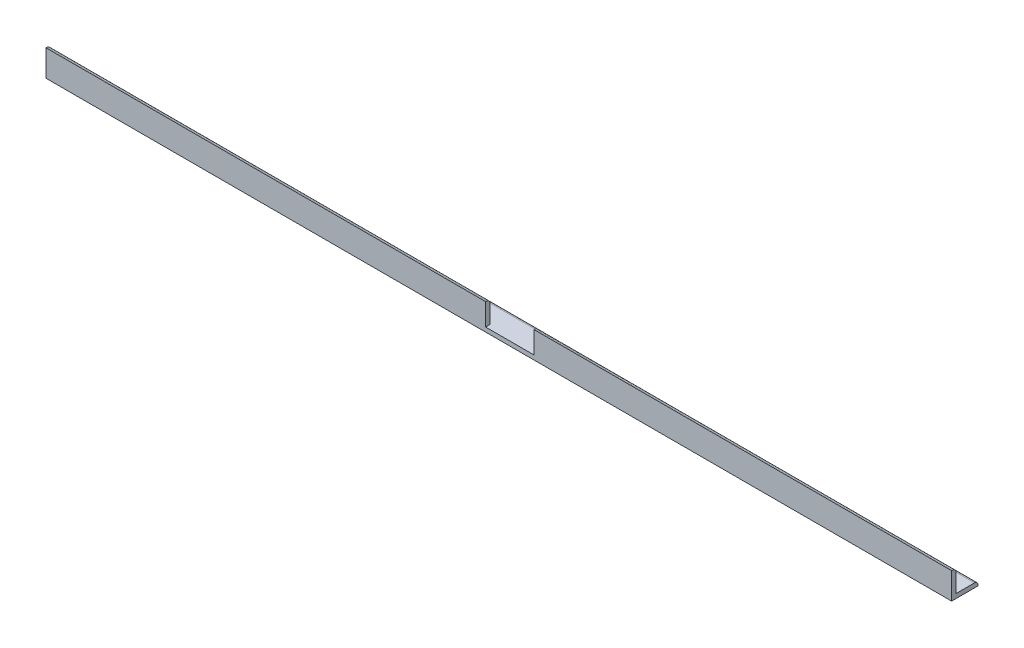
ISO-10303-21;
HEADER;
FILE_DESCRIPTION(('STEP AP214'),'2;1');
FILE_NAME('part.step','',(''),(''),'','','');
FILE_SCHEMA(('AUTOMOTIVE_DESIGN { 1 0 10303 214 1 1 1 1 }'));
ENDSEC;
DATA;
#1=APPLICATION_CONTEXT('core data for automotive mechanical design processes');
#2=APPLICATION_PROTOCOL_DEFINITION('international standard','automotive_design',2000,#1);
#3=PRODUCT_CONTEXT('',#1,'mechanical');
#4=PRODUCT('Part','Part','',(#3));
#5=PRODUCT_RELATED_PRODUCT_CATEGORY('part','',(#4));
#6=PRODUCT_DEFINITION_FORMATION('','',#4);
#7=PRODUCT_DEFINITION_CONTEXT('part definition',#1,'design');
#8=PRODUCT_DEFINITION('design','',#6,#7);
#9=PRODUCT_DEFINITION_SHAPE('','',#8);
#10=(LENGTH_UNIT() NAMED_UNIT(*) SI_UNIT(.MILLI.,.METRE.));
#11=(NAMED_UNIT(*) PLANE_ANGLE_UNIT() SI_UNIT($,.RADIAN.));
#12=(NAMED_UNIT(*) SI_UNIT($,.STERADIAN.) SOLID_ANGLE_UNIT());
#13=UNCERTAINTY_MEASURE_WITH_UNIT(LENGTH_MEASURE(1.E-05),#10,'distance_accuracy_value','');
#14=(GEOMETRIC_REPRESENTATION_CONTEXT(3) GLOBAL_UNCERTAINTY_ASSIGNED_CONTEXT((#13)) GLOBAL_UNIT_ASSIGNED_CONTEXT((#10,
#11,#12)) REPRESENTATION_CONTEXT('',''));
#15=CARTESIAN_POINT('',(0.,0.,0.));
#16=DIRECTION('',(0.,0.,1.));
#17=DIRECTION('',(1.,0.,0.));
#18=AXIS2_PLACEMENT_3D('',#15,#16,#17);
#19=CARTESIAN_POINT('',(654.07286,3.175,-3.175));
#20=DIRECTION('',(0.,0.,1.));
#21=DIRECTION('',(1.,0.,0.));
#22=AXIS2_PLACEMENT_3D('',#19,#20,#21);
#23=PLANE('',#22);
#24=DIRECTION('',(-1.,0.,0.));
#25=VECTOR('',#24,1.);
#26=CARTESIAN_POINT('',(654.07286,3.175,-3.175));
#27=LINE('',#26,#25);
#28=CARTESIAN_POINT('',(654.07286,3.175,-3.175));
#29=VERTEX_POINT('',#28);
#30=CARTESIAN_POINT('',(352.44786,3.175,-3.175));
#31=VERTEX_POINT('',#30);
#32=EDGE_CURVE('E196',#29,#31,#27,.T.);
#33=ORIENTED_EDGE('',*,*,#32,.T.);
#34=DIRECTION('',(0.,-1.,0.));
#35=VECTOR('',#34,1.);
#36=CARTESIAN_POINT('',(352.44786,3.175,-3.175));
#37=LINE('',#36,#35);
#38=CARTESIAN_POINT('',(352.44786,16.51,-3.175));
#39=VERTEX_POINT('',#38);
#40=EDGE_CURVE('E151',#39,#31,#37,.T.);
#41=ORIENTED_EDGE('',*,*,#40,.F.);
#42=DIRECTION('',(-1.,0.,0.));
#43=VECTOR('',#42,1.);
#44=CARTESIAN_POINT('',(654.07286,16.51,-3.175));
#45=LINE('',#44,#43);
#46=CARTESIAN_POINT('',(654.07286,16.51,-3.175));
#47=VERTEX_POINT('',#46);
#48=EDGE_CURVE('E148',#47,#39,#45,.T.);
#49=ORIENTED_EDGE('',*,*,#48,.F.);
#50=DIRECTION('',(0.,1.,0.));
#51=VECTOR('',#50,1.);
#52=CARTESIAN_POINT('',(654.07286,3.175,-3.175));
#53=LINE('',#52,#51);
#54=EDGE_CURVE('E133',#29,#47,#53,.T.);
#55=ORIENTED_EDGE('',*,*,#54,.F.);
#56=EDGE_LOOP('',(#33,#41,#49,#55));
#57=FACE_BOUND('',#56,.T.);
#58=ADVANCED_FACE('F39',(#57),#23,.F.);
#59=CARTESIAN_POINT('',(654.07286,16.51,-0.635));
#60=DIRECTION('',(-1.,0.,0.));
#61=DIRECTION('',(0.,0.,1.));
#62=AXIS2_PLACEMENT_3D('',#59,#60,#61);
#63=CYLINDRICAL_SURFACE('',#62,2.54);
#64=ORIENTED_EDGE('',*,*,#48,.T.);
#65=CARTESIAN_POINT('',(352.44786,16.51,-0.635));
#66=DIRECTION('',(1.,0.,0.));
#67=DIRECTION('',(0.,0.,-1.));
#68=AXIS2_PLACEMENT_3D('',#65,#66,#67);
#69=CIRCLE('',#68,2.54);
#70=CARTESIAN_POINT('',(352.44786,19.05,-0.634999999999982));
#71=VERTEX_POINT('',#70);
#72=EDGE_CURVE('E228',#39,#71,#69,.T.);
#73=ORIENTED_EDGE('',*,*,#72,.T.);
#74=DIRECTION('',(-1.,0.,0.));
#75=VECTOR('',#74,1.);
#76=CARTESIAN_POINT('',(654.07286,19.05,-0.634999999999982));
#77=LINE('',#76,#75);
#78=CARTESIAN_POINT('',(654.07286,19.05,-0.634999999999982));
#79=VERTEX_POINT('',#78);
#80=EDGE_CURVE('E160',#79,#71,#77,.T.);
#81=ORIENTED_EDGE('',*,*,#80,.F.);
#82=CARTESIAN_POINT('',(654.07286,16.51,-0.635));
#83=DIRECTION('',(1.,0.,0.));
#84=DIRECTION('',(0.,0.,-1.));
#85=AXIS2_PLACEMENT_3D('',#82,#83,#84);
#86=CIRCLE('',#85,2.54);
#87=EDGE_CURVE('E137',#47,#79,#86,.T.);
#88=ORIENTED_EDGE('',*,*,#87,.F.);
#89=EDGE_LOOP('',(#64,#73,#81,#88));
#90=FACE_BOUND('',#89,.T.);
#91=ADVANCED_FACE('F158',(#90),#63,.T.);
#92=CARTESIAN_POINT('',(654.07286,19.05,0.));
#93=DIRECTION('',(0.,-1.,0.));
#94=DIRECTION('',(0.,0.,-1.));
#95=AXIS2_PLACEMENT_3D('',#92,#93,#94);
#96=PLANE('',#95);
#97=ORIENTED_EDGE('',*,*,#80,.T.);
#98=DIRECTION('',(0.,0.,1.));
#99=VECTOR('',#98,1.);
#100=CARTESIAN_POINT('',(352.44786,19.05,0.));
#101=LINE('',#100,#99);
#102=CARTESIAN_POINT('',(352.44786,19.05,0.));
#103=VERTEX_POINT('',#102);
#104=EDGE_CURVE('E11',#71,#103,#101,.T.);
#105=ORIENTED_EDGE('',*,*,#104,.T.);
#106=DIRECTION('',(-1.,0.,0.));
#107=VECTOR('',#106,1.);
#108=CARTESIAN_POINT('',(654.07286,19.05,0.));
#109=LINE('',#108,#107);
#110=CARTESIAN_POINT('',(654.07286,19.05,0.));
#111=VERTEX_POINT('',#110);
#112=EDGE_CURVE('E189',#111,#103,#109,.T.);
#113=ORIENTED_EDGE('',*,*,#112,.F.);
#114=DIRECTION('',(0.,0.,1.));
#115=VECTOR('',#114,1.);
#116=CARTESIAN_POINT('',(654.07286,19.05,0.));
#117=LINE('',#116,#115);
#118=EDGE_CURVE('E70',#79,#111,#117,.T.);
#119=ORIENTED_EDGE('',*,*,#118,.F.);
#120=EDGE_LOOP('',(#97,#105,#113,#119));
#121=FACE_BOUND('',#120,.T.);
#122=ADVANCED_FACE('F305',(#121),#96,.F.);
#123=CARTESIAN_POINT('',(654.07286,0.,0.));
#124=DIRECTION('',(0.,0.,-1.));
#125=DIRECTION('',(-1.,0.,0.));
#126=AXIS2_PLACEMENT_3D('',#123,#124,#125);
#127=PLANE('',#126);
#128=ORIENTED_EDGE('',*,*,#112,.T.);
#129=DIRECTION('',(0.,-1.,0.));
#130=VECTOR('',#129,1.);
#131=CARTESIAN_POINT('',(352.44786,3.175,0.));
#132=LINE('',#131,#130);
#133=CARTESIAN_POINT('',(352.44786,3.175,0.));
#134=VERTEX_POINT('',#133);
#135=EDGE_CURVE('E232',#103,#134,#132,.T.);
#136=ORIENTED_EDGE('',*,*,#135,.T.);
#137=DIRECTION('',(-1.,0.,0.));
#138=VECTOR('',#137,1.);
#139=CARTESIAN_POINT('',(352.44786,3.175,0.));
#140=LINE('',#139,#138);
#141=CARTESIAN_POINT('',(317.52286,3.175,0.));
#142=VERTEX_POINT('',#141);
#143=EDGE_CURVE('E234',#134,#142,#140,.T.);
#144=ORIENTED_EDGE('',*,*,#143,.T.);
#145=DIRECTION('',(0.,1.,0.));
#146=VECTOR('',#145,1.);
#147=CARTESIAN_POINT('',(317.52286,3.175,0.));
#148=LINE('',#147,#146);
#149=CARTESIAN_POINT('',(317.52286,19.05,0.));
#150=VERTEX_POINT('',#149);
#151=EDGE_CURVE('E327',#142,#150,#148,.T.);
#152=ORIENTED_EDGE('',*,*,#151,.T.);
#153=CARTESIAN_POINT('',(0.,19.05,0.));
#154=VERTEX_POINT('',#153);
#155=EDGE_CURVE('E104',#150,#154,#109,.T.);
#156=ORIENTED_EDGE('',*,*,#155,.T.);
#157=DIRECTION('',(0.,-1.,0.));
#158=VECTOR('',#157,1.);
#159=CARTESIAN_POINT('',(0.,0.,0.));
#160=LINE('',#159,#158);
#161=CARTESIAN_POINT('',(0.,0.,0.));
#162=VERTEX_POINT('',#161);
#163=EDGE_CURVE('E168',#154,#162,#160,.T.);
#164=ORIENTED_EDGE('',*,*,#163,.T.);
#165=DIRECTION('',(-1.,0.,0.));
#166=VECTOR('',#165,1.);
#167=CARTESIAN_POINT('',(654.07286,0.,0.));
#168=LINE('',#167,#166);
#169=CARTESIAN_POINT('',(654.07286,0.,0.));
#170=VERTEX_POINT('',#169);
#171=EDGE_CURVE('E211',#170,#162,#168,.T.);
#172=ORIENTED_EDGE('',*,*,#171,.F.);
#173=DIRECTION('',(0.,-1.,0.));
#174=VECTOR('',#173,1.);
#175=CARTESIAN_POINT('',(654.07286,0.,0.));
#176=LINE('',#175,#174);
#177=EDGE_CURVE('E188',#111,#170,#176,.T.);
#178=ORIENTED_EDGE('',*,*,#177,.F.);
#179=EDGE_LOOP('',(#128,#136,#144,#152,#156,#164,#172,#178));
#180=FACE_BOUND('',#179,.T.);
#181=ADVANCED_FACE('F41',(#180),#127,.F.);
#182=CARTESIAN_POINT('',(654.07286,0.,0.));
#183=DIRECTION('',(0.,1.,0.));
#184=DIRECTION('',(0.,0.,1.));
#185=AXIS2_PLACEMENT_3D('',#182,#183,#184);
#186=PLANE('',#185);
#187=CARTESIAN_POINT('',(641.37286,0.,-9.84249999999998));
#188=DIRECTION('',(0.,1.,0.));
#189=DIRECTION('',(0.,0.,1.));
#190=AXIS2_PLACEMENT_3D('',#187,#188,#189);
#191=CIRCLE('',#190,2.53999999999996);
#192=CARTESIAN_POINT('',(641.37286,0.,-7.30250000000003));
#193=VERTEX_POINT('',#192);
#194=EDGE_CURVE('E171',#193,#193,#191,.F.);
#195=ORIENTED_EDGE('',*,*,#194,.F.);
#196=EDGE_LOOP('',(#195));
#197=FACE_BOUND('',#196,.T.);
#198=CARTESIAN_POINT('',(12.6999999999999,0.,-9.84249999999991));
#199=DIRECTION('',(0.,1.,0.));
#200=DIRECTION('',(0.,0.,1.));
#201=AXIS2_PLACEMENT_3D('',#198,#199,#200);
#202=CIRCLE('',#201,2.54);
#203=CARTESIAN_POINT('',(12.6999999999999,0.,-7.30249999999991));
#204=VERTEX_POINT('',#203);
#205=EDGE_CURVE('E244',#204,#204,#202,.F.);
#206=ORIENTED_EDGE('',*,*,#205,.F.);
#207=EDGE_LOOP('',(#206));
#208=FACE_BOUND('',#207,.T.);
#209=DIRECTION('',(0.,0.,-1.));
#210=VECTOR('',#209,1.);
#211=CARTESIAN_POINT('',(0.,0.,0.));
#212=LINE('',#211,#210);
#213=CARTESIAN_POINT('',(0.,0.,-19.05));
#214=VERTEX_POINT('',#213);
#215=EDGE_CURVE('E170',#162,#214,#212,.T.);
#216=ORIENTED_EDGE('',*,*,#215,.T.);
#217=DIRECTION('',(-1.,0.,0.));
#218=VECTOR('',#217,1.);
#219=CARTESIAN_POINT('',(654.07286,0.,-19.05));
#220=LINE('',#219,#218);
#221=CARTESIAN_POINT('',(654.07286,0.,-19.05));
#222=VERTEX_POINT('',#221);
#223=EDGE_CURVE('E207',#222,#214,#220,.T.);
#224=ORIENTED_EDGE('',*,*,#223,.F.);
#225=DIRECTION('',(0.,0.,-1.));
#226=VECTOR('',#225,1.);
#227=CARTESIAN_POINT('',(654.07286,0.,0.));
#228=LINE('',#227,#226);
#229=EDGE_CURVE('E115',#170,#222,#228,.T.);
#230=ORIENTED_EDGE('',*,*,#229,.F.);
#231=ORIENTED_EDGE('',*,*,#171,.T.);
#232=EDGE_LOOP('',(#216,#224,#230,#231));
#233=FACE_BOUND('',#232,.T.);
#234=ADVANCED_FACE('F309',(#197,#208,#233),#186,.F.);
#235=CARTESIAN_POINT('',(654.07286,0.,-19.05));
#236=DIRECTION('',(0.,0.,1.));
#237=DIRECTION('',(1.,0.,0.));
#238=AXIS2_PLACEMENT_3D('',#235,#236,#237);
#239=PLANE('',#238);
#240=DIRECTION('',(0.,1.,0.));
#241=VECTOR('',#240,1.);
#242=CARTESIAN_POINT('',(0.,0.,-19.05));
#243=LINE('',#242,#241);
#244=CARTESIAN_POINT('',(0.,0.634999999999981,-19.05));
#245=VERTEX_POINT('',#244);
#246=EDGE_CURVE('E173',#214,#245,#243,.T.);
#247=ORIENTED_EDGE('',*,*,#246,.T.);
#248=DIRECTION('',(-1.,0.,0.));
#249=VECTOR('',#248,1.);
#250=CARTESIAN_POINT('',(654.07286,0.634999999999981,-19.05));
#251=LINE('',#250,#249);
#252=CARTESIAN_POINT('',(654.07286,0.634999999999981,-19.05));
#253=VERTEX_POINT('',#252);
#254=EDGE_CURVE('E203',#253,#245,#251,.T.);
#255=ORIENTED_EDGE('',*,*,#254,.F.);
#256=DIRECTION('',(0.,1.,0.));
#257=VECTOR('',#256,1.);
#258=CARTESIAN_POINT('',(654.07286,0.,-19.05));
#259=LINE('',#258,#257);
#260=EDGE_CURVE('E260',#222,#253,#259,.T.);
#261=ORIENTED_EDGE('',*,*,#260,.F.);
#262=ORIENTED_EDGE('',*,*,#223,.T.);
#263=EDGE_LOOP('',(#247,#255,#261,#262));
#264=FACE_BOUND('',#263,.T.);
#265=ADVANCED_FACE('F312',(#264),#239,.F.);
#266=CARTESIAN_POINT('',(654.07286,0.635,-16.51));
#267=DIRECTION('',(-1.,0.,0.));
#268=DIRECTION('',(0.,0.,1.));
#269=AXIS2_PLACEMENT_3D('',#266,#267,#268);
#270=CYLINDRICAL_SURFACE('',#269,2.54);
#271=CARTESIAN_POINT('',(0.,0.635,-16.51));
#272=DIRECTION('',(1.,0.,0.));
#273=DIRECTION('',(0.,0.,1.));
#274=AXIS2_PLACEMENT_3D('',#271,#272,#273);
#275=CIRCLE('',#274,2.54);
#276=CARTESIAN_POINT('',(0.,3.175,-16.51));
#277=VERTEX_POINT('',#276);
#278=EDGE_CURVE('E175',#245,#277,#275,.T.);
#279=ORIENTED_EDGE('',*,*,#278,.T.);
#280=DIRECTION('',(-1.,0.,0.));
#281=VECTOR('',#280,1.);
#282=CARTESIAN_POINT('',(654.07286,3.175,-16.51));
#283=LINE('',#282,#281);
#284=CARTESIAN_POINT('',(654.07286,3.175,-16.51));
#285=VERTEX_POINT('',#284);
#286=EDGE_CURVE('E199',#285,#277,#283,.T.);
#287=ORIENTED_EDGE('',*,*,#286,.F.);
#288=CARTESIAN_POINT('',(654.07286,0.635,-16.51));
#289=DIRECTION('',(1.,0.,0.));
#290=DIRECTION('',(0.,0.,1.));
#291=AXIS2_PLACEMENT_3D('',#288,#289,#290);
#292=CIRCLE('',#291,2.54);
#293=EDGE_CURVE('E263',#253,#285,#292,.T.);
#294=ORIENTED_EDGE('',*,*,#293,.F.);
#295=ORIENTED_EDGE('',*,*,#254,.T.);
#296=EDGE_LOOP('',(#279,#287,#294,#295));
#297=FACE_BOUND('',#296,.T.);
#298=ADVANCED_FACE('F271',(#297),#270,.T.);
#299=CARTESIAN_POINT('',(654.07286,3.175,-3.175));
#300=DIRECTION('',(0.,-1.,0.));
#301=DIRECTION('',(0.,0.,-1.));
#302=AXIS2_PLACEMENT_3D('',#299,#300,#301);
#303=PLANE('',#302);
#304=CARTESIAN_POINT('',(641.37286,3.175,-9.84249999999998));
#305=DIRECTION('',(0.,1.,0.));
#306=DIRECTION('',(0.,0.,1.));
#307=AXIS2_PLACEMENT_3D('',#304,#305,#306);
#308=CIRCLE('',#307,2.53999999999996);
#309=CARTESIAN_POINT('',(641.37286,3.175,-7.30250000000003));
#310=VERTEX_POINT('',#309);
#311=EDGE_CURVE('E248',#310,#310,#308,.T.);
#312=ORIENTED_EDGE('',*,*,#311,.F.);
#313=EDGE_LOOP('',(#312));
#314=FACE_BOUND('',#313,.T.);
#315=CARTESIAN_POINT('',(12.6999999999999,3.175,-9.84249999999991));
#316=DIRECTION('',(0.,1.,0.));
#317=DIRECTION('',(0.,0.,1.));
#318=AXIS2_PLACEMENT_3D('',#315,#316,#317);
#319=CIRCLE('',#318,2.54);
#320=CARTESIAN_POINT('',(12.6999999999999,3.175,-7.30249999999991));
#321=VERTEX_POINT('',#320);
#322=EDGE_CURVE('E240',#321,#321,#319,.T.);
#323=ORIENTED_EDGE('',*,*,#322,.F.);
#324=EDGE_LOOP('',(#323));
#325=FACE_BOUND('',#324,.T.);
#326=DIRECTION('',(0.,0.,1.));
#327=VECTOR('',#326,1.);
#328=CARTESIAN_POINT('',(0.,3.175,-3.175));
#329=LINE('',#328,#327);
#330=CARTESIAN_POINT('',(0.,3.175,-3.175));
#331=VERTEX_POINT('',#330);
#332=EDGE_CURVE('E177',#277,#331,#329,.T.);
#333=ORIENTED_EDGE('',*,*,#332,.T.);
#334=CARTESIAN_POINT('',(317.52286,3.175,-3.175));
#335=VERTEX_POINT('',#334);
#336=EDGE_CURVE('E155',#335,#331,#27,.T.);
#337=ORIENTED_EDGE('',*,*,#336,.F.);
#338=DIRECTION('',(0.,0.,-1.));
#339=VECTOR('',#338,1.);
#340=CARTESIAN_POINT('',(317.52286,3.175,0.));
#341=LINE('',#340,#339);
#342=EDGE_CURVE('E229',#142,#335,#341,.T.);
#343=ORIENTED_EDGE('',*,*,#342,.F.);
#344=ORIENTED_EDGE('',*,*,#143,.F.);
#345=DIRECTION('',(0.,0.,-1.));
#346=VECTOR('',#345,1.);
#347=CARTESIAN_POINT('',(352.44786,3.175,0.));
#348=LINE('',#347,#346);
#349=EDGE_CURVE('E280',#134,#31,#348,.T.);
#350=ORIENTED_EDGE('',*,*,#349,.T.);
#351=ORIENTED_EDGE('',*,*,#32,.F.);
#352=DIRECTION('',(0.,0.,1.));
#353=VECTOR('',#352,1.);
#354=CARTESIAN_POINT('',(654.07286,3.175,-3.175));
#355=LINE('',#354,#353);
#356=EDGE_CURVE('E140',#285,#29,#355,.T.);
#357=ORIENTED_EDGE('',*,*,#356,.F.);
#358=ORIENTED_EDGE('',*,*,#286,.T.);
#359=EDGE_LOOP('',(#333,#337,#343,#344,#350,#351,#357,#358));
#360=FACE_BOUND('',#359,.T.);
#361=ADVANCED_FACE('F275',(#314,#325,#360),#303,.F.);
#362=CARTESIAN_POINT('',(317.52286,16.51,-3.175));
#363=VERTEX_POINT('',#362);
#364=CARTESIAN_POINT('',(0.,16.51,-3.175));
#365=VERTEX_POINT('',#364);
#366=EDGE_CURVE('E156',#363,#365,#45,.T.);
#367=ORIENTED_EDGE('',*,*,#366,.F.);
#368=DIRECTION('',(0.,1.,0.));
#369=VECTOR('',#368,1.);
#370=CARTESIAN_POINT('',(317.52286,3.175,-3.175));
#371=LINE('',#370,#369);
#372=EDGE_CURVE('E235',#335,#363,#371,.T.);
#373=ORIENTED_EDGE('',*,*,#372,.F.);
#374=ORIENTED_EDGE('',*,*,#336,.T.);
#375=DIRECTION('',(0.,1.,0.));
#376=VECTOR('',#375,1.);
#377=CARTESIAN_POINT('',(0.,3.175,-3.175));
#378=LINE('',#377,#376);
#379=EDGE_CURVE('E180',#331,#365,#378,.T.);
#380=ORIENTED_EDGE('',*,*,#379,.T.);
#381=EDGE_LOOP('',(#367,#373,#374,#380));
#382=FACE_BOUND('',#381,.T.);
#383=ADVANCED_FACE('F333',(#382),#23,.F.);
#384=CARTESIAN_POINT('',(317.52286,19.05,-0.634999999999982));
#385=VERTEX_POINT('',#384);
#386=CARTESIAN_POINT('',(0.,19.05,-0.634999999999982));
#387=VERTEX_POINT('',#386);
#388=EDGE_CURVE('E193',#385,#387,#77,.T.);
#389=ORIENTED_EDGE('',*,*,#388,.F.);
#390=CARTESIAN_POINT('',(317.52286,16.51,-0.635));
#391=DIRECTION('',(-1.,0.,0.));
#392=DIRECTION('',(0.,0.,1.));
#393=AXIS2_PLACEMENT_3D('',#390,#391,#392);
#394=CIRCLE('',#393,2.54);
#395=EDGE_CURVE('E58',#385,#363,#394,.T.);
#396=ORIENTED_EDGE('',*,*,#395,.T.);
#397=ORIENTED_EDGE('',*,*,#366,.T.);
#398=CARTESIAN_POINT('',(0.,16.51,-0.635));
#399=DIRECTION('',(1.,0.,0.));
#400=DIRECTION('',(0.,0.,-1.));
#401=AXIS2_PLACEMENT_3D('',#398,#399,#400);
#402=CIRCLE('',#401,2.54);
#403=EDGE_CURVE('E183',#365,#387,#402,.T.);
#404=ORIENTED_EDGE('',*,*,#403,.T.);
#405=EDGE_LOOP('',(#389,#396,#397,#404));
#406=FACE_BOUND('',#405,.T.);
#407=ADVANCED_FACE('F222',(#406),#63,.T.);
#408=ORIENTED_EDGE('',*,*,#155,.F.);
#409=DIRECTION('',(0.,0.,-1.));
#410=VECTOR('',#409,1.);
#411=CARTESIAN_POINT('',(317.52286,19.05,0.));
#412=LINE('',#411,#410);
#413=EDGE_CURVE('E48',#150,#385,#412,.T.);
#414=ORIENTED_EDGE('',*,*,#413,.T.);
#415=ORIENTED_EDGE('',*,*,#388,.T.);
#416=DIRECTION('',(0.,0.,1.));
#417=VECTOR('',#416,1.);
#418=CARTESIAN_POINT('',(0.,19.05,0.));
#419=LINE('',#418,#417);
#420=EDGE_CURVE('E186',#387,#154,#419,.T.);
#421=ORIENTED_EDGE('',*,*,#420,.T.);
#422=EDGE_LOOP('',(#408,#414,#415,#421));
#423=FACE_BOUND('',#422,.T.);
#424=ADVANCED_FACE('F218',(#423),#96,.F.);
#425=CARTESIAN_POINT('',(654.07286,16.51,-0.635));
#426=DIRECTION('',(1.,0.,0.));
#427=DIRECTION('',(0.,0.,-1.));
#428=AXIS2_PLACEMENT_3D('',#425,#426,#427);
#429=PLANE('',#428);
#430=ORIENTED_EDGE('',*,*,#177,.T.);
#431=ORIENTED_EDGE('',*,*,#229,.T.);
#432=ORIENTED_EDGE('',*,*,#260,.T.);
#433=ORIENTED_EDGE('',*,*,#293,.T.);
#434=ORIENTED_EDGE('',*,*,#356,.T.);
#435=ORIENTED_EDGE('',*,*,#54,.T.);
#436=ORIENTED_EDGE('',*,*,#87,.T.);
#437=ORIENTED_EDGE('',*,*,#118,.T.);
#438=EDGE_LOOP('',(#430,#431,#432,#433,#434,#435,#436,#437));
#439=FACE_BOUND('',#438,.T.);
#440=ADVANCED_FACE('F135',(#439),#429,.T.);
#441=CARTESIAN_POINT('',(0.,16.51,-0.635));
#442=DIRECTION('',(1.,0.,0.));
#443=DIRECTION('',(0.,0.,-1.));
#444=AXIS2_PLACEMENT_3D('',#441,#442,#443);
#445=PLANE('',#444);
#446=ORIENTED_EDGE('',*,*,#163,.F.);
#447=ORIENTED_EDGE('',*,*,#420,.F.);
#448=ORIENTED_EDGE('',*,*,#403,.F.);
#449=ORIENTED_EDGE('',*,*,#379,.F.);
#450=ORIENTED_EDGE('',*,*,#332,.F.);
#451=ORIENTED_EDGE('',*,*,#278,.F.);
#452=ORIENTED_EDGE('',*,*,#246,.F.);
#453=ORIENTED_EDGE('',*,*,#215,.F.);
#454=EDGE_LOOP('',(#446,#447,#448,#449,#450,#451,#452,#453));
#455=FACE_BOUND('',#454,.T.);
#456=ADVANCED_FACE('F315',(#455),#445,.F.);
#457=CARTESIAN_POINT('',(12.6999999999999,-0.00100000000000013,-9.84249999999991));
#458=DIRECTION('',(0.,1.,0.));
#459=DIRECTION('',(0.,0.,1.));
#460=AXIS2_PLACEMENT_3D('',#457,#458,#459);
#461=CYLINDRICAL_SURFACE('',#460,2.54);
#462=ORIENTED_EDGE('',*,*,#322,.T.);
#463=EDGE_LOOP('',(#462));
#464=FACE_BOUND('',#463,.T.);
#465=ORIENTED_EDGE('',*,*,#205,.T.);
#466=EDGE_LOOP('',(#465));
#467=FACE_BOUND('',#466,.T.);
#468=ADVANCED_FACE('F356',(#464,#467),#461,.F.);
#469=CARTESIAN_POINT('',(641.37286,-0.00100000000000013,-9.84249999999998));
#470=DIRECTION('',(0.,1.,0.));
#471=DIRECTION('',(0.,0.,1.));
#472=AXIS2_PLACEMENT_3D('',#469,#470,#471);
#473=CYLINDRICAL_SURFACE('',#472,2.53999999999996);
#474=ORIENTED_EDGE('',*,*,#311,.T.);
#475=EDGE_LOOP('',(#474));
#476=FACE_BOUND('',#475,.T.);
#477=ORIENTED_EDGE('',*,*,#194,.T.);
#478=EDGE_LOOP('',(#477));
#479=FACE_BOUND('',#478,.T.);
#480=ADVANCED_FACE('F361',(#476,#479),#473,.F.);
#481=CARTESIAN_POINT('',(352.44786,3.175,0.));
#482=DIRECTION('',(1.,0.,0.));
#483=DIRECTION('',(0.,0.,-1.));
#484=AXIS2_PLACEMENT_3D('',#481,#482,#483);
#485=PLANE('',#484);
#486=ORIENTED_EDGE('',*,*,#40,.T.);
#487=ORIENTED_EDGE('',*,*,#349,.F.);
#488=ORIENTED_EDGE('',*,*,#135,.F.);
#489=ORIENTED_EDGE('',*,*,#104,.F.);
#490=ORIENTED_EDGE('',*,*,#72,.F.);
#491=EDGE_LOOP('',(#486,#487,#488,#489,#490));
#492=FACE_BOUND('',#491,.T.);
#493=ADVANCED_FACE('F303',(#492),#485,.F.);
#494=CARTESIAN_POINT('',(317.52286,3.175,0.));
#495=DIRECTION('',(-1.,0.,0.));
#496=DIRECTION('',(0.,0.,1.));
#497=AXIS2_PLACEMENT_3D('',#494,#495,#496);
#498=PLANE('',#497);
#499=ORIENTED_EDGE('',*,*,#413,.F.);
#500=ORIENTED_EDGE('',*,*,#151,.F.);
#501=ORIENTED_EDGE('',*,*,#342,.T.);
#502=ORIENTED_EDGE('',*,*,#372,.T.);
#503=ORIENTED_EDGE('',*,*,#395,.F.);
#504=EDGE_LOOP('',(#499,#500,#501,#502,#503));
#505=FACE_BOUND('',#504,.T.);
#506=ADVANCED_FACE('F332',(#505),#498,.F.);
#507=CLOSED_SHELL('',(#58,#91,#122,#181,#234,#265,#298,#361,#383,#407,#424,#440,#456,#468,#480,
#493,#506));
#508=MANIFOLD_SOLID_BREP('B2',#507);
#509=ADVANCED_BREP_SHAPE_REPRESENTATION('',(#18,#508),#14);
#510=SHAPE_DEFINITION_REPRESENTATION(#9,#509);
ENDSEC;
END-ISO-10303-21;
